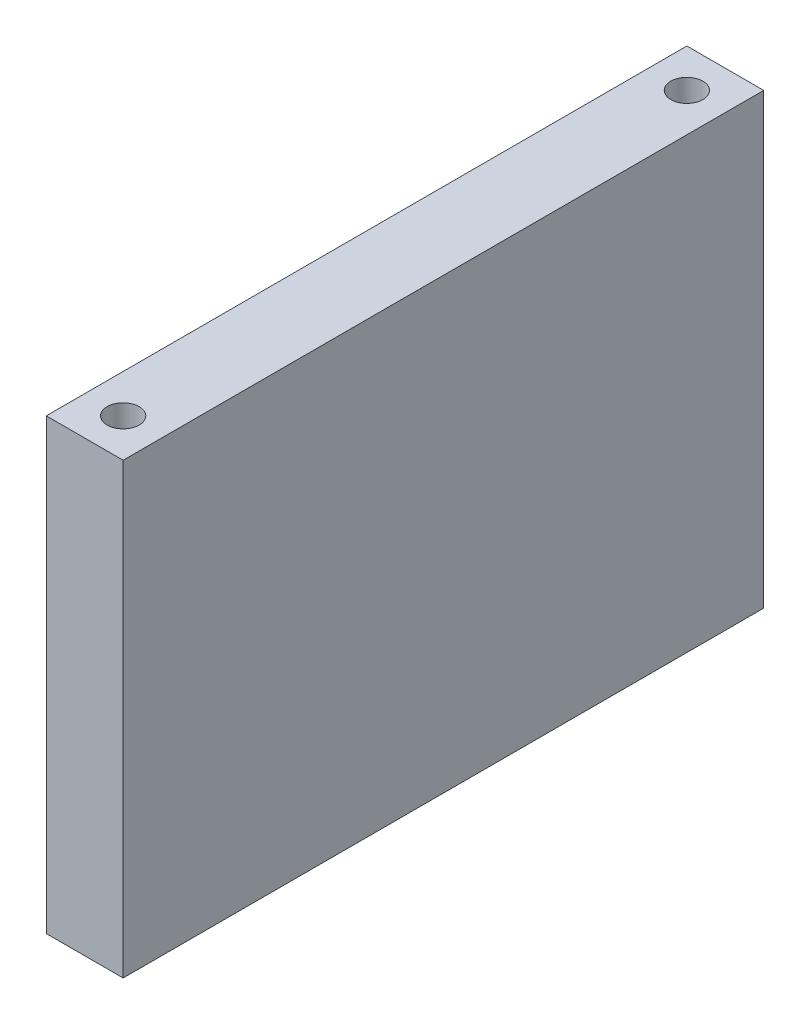
ISO-10303-21;
HEADER;
FILE_DESCRIPTION(('STEP AP214'),'2;1');
FILE_NAME('part.step','',(''),(''),'','','');
FILE_SCHEMA(('AUTOMOTIVE_DESIGN { 1 0 10303 214 1 1 1 1 }'));
ENDSEC;
DATA;
#1=APPLICATION_CONTEXT('core data for automotive mechanical design processes');
#2=APPLICATION_PROTOCOL_DEFINITION('international standard','automotive_design',2000,#1);
#3=PRODUCT_CONTEXT('',#1,'mechanical');
#4=PRODUCT('Part','Part','',(#3));
#5=PRODUCT_RELATED_PRODUCT_CATEGORY('part','',(#4));
#6=PRODUCT_DEFINITION_FORMATION('','',#4);
#7=PRODUCT_DEFINITION_CONTEXT('part definition',#1,'design');
#8=PRODUCT_DEFINITION('design','',#6,#7);
#9=PRODUCT_DEFINITION_SHAPE('','',#8);
#10=(LENGTH_UNIT() NAMED_UNIT(*) SI_UNIT(.MILLI.,.METRE.));
#11=(NAMED_UNIT(*) PLANE_ANGLE_UNIT() SI_UNIT($,.RADIAN.));
#12=(NAMED_UNIT(*) SI_UNIT($,.STERADIAN.) SOLID_ANGLE_UNIT());
#13=UNCERTAINTY_MEASURE_WITH_UNIT(LENGTH_MEASURE(1.E-05),#10,'distance_accuracy_value','');
#14=(GEOMETRIC_REPRESENTATION_CONTEXT(3) GLOBAL_UNCERTAINTY_ASSIGNED_CONTEXT((#13)) GLOBAL_UNIT_ASSIGNED_CONTEXT((#10,
#11,#12)) REPRESENTATION_CONTEXT('',''));
#15=CARTESIAN_POINT('',(0.,0.,0.));
#16=DIRECTION('',(0.,0.,1.));
#17=DIRECTION('',(1.,0.,0.));
#18=AXIS2_PLACEMENT_3D('',#15,#16,#17);
#19=CARTESIAN_POINT('',(0.,0.,0.));
#20=DIRECTION('',(0.,-1.,0.));
#21=DIRECTION('',(1.,0.,0.));
#22=AXIS2_PLACEMENT_3D('',#19,#20,#21);
#23=PLANE('',#22);
#24=DIRECTION('',(1.,0.,0.));
#25=VECTOR('',#24,1.);
#26=CARTESIAN_POINT('',(0.,0.,25.));
#27=LINE('',#26,#25);
#28=CARTESIAN_POINT('',(19.,0.,25.));
#29=VERTEX_POINT('',#28);
#30=CARTESIAN_POINT('',(25.,0.,25.));
#31=VERTEX_POINT('',#30);
#32=EDGE_CURVE('E74',#29,#31,#27,.T.);
#33=ORIENTED_EDGE('',*,*,#32,.T.);
#34=DIRECTION('',(0.,0.,1.));
#35=VECTOR('',#34,1.);
#36=CARTESIAN_POINT('',(25.,0.,0.));
#37=LINE('',#36,#35);
#38=CARTESIAN_POINT('',(25.,0.,-25.));
#39=VERTEX_POINT('',#38);
#40=EDGE_CURVE('E11',#39,#31,#37,.T.);
#41=ORIENTED_EDGE('',*,*,#40,.F.);
#42=DIRECTION('',(1.,0.,0.));
#43=VECTOR('',#42,1.);
#44=CARTESIAN_POINT('',(0.,0.,-25.));
#45=LINE('',#44,#43);
#46=CARTESIAN_POINT('',(19.,0.,-25.));
#47=VERTEX_POINT('',#46);
#48=EDGE_CURVE('E27',#47,#39,#45,.T.);
#49=ORIENTED_EDGE('',*,*,#48,.F.);
#50=DIRECTION('',(0.,0.,-1.));
#51=VECTOR('',#50,1.);
#52=CARTESIAN_POINT('',(19.,0.,0.));
#53=LINE('',#52,#51);
#54=EDGE_CURVE('E117',#29,#47,#53,.T.);
#55=ORIENTED_EDGE('',*,*,#54,.F.);
#56=EDGE_LOOP('',(#33,#41,#49,#55));
#57=FACE_BOUND('',#56,.T.);
#58=CARTESIAN_POINT('',(22.,0.,-22.));
#59=DIRECTION('',(0.,-1.,0.));
#60=DIRECTION('',(0.,0.,-1.));
#61=AXIS2_PLACEMENT_3D('',#58,#59,#60);
#62=CIRCLE('',#61,1.25);
#63=CARTESIAN_POINT('',(22.,0.,-23.25));
#64=VERTEX_POINT('',#63);
#65=EDGE_CURVE('E144',#64,#64,#62,.T.);
#66=ORIENTED_EDGE('',*,*,#65,.T.);
#67=EDGE_LOOP('',(#66));
#68=FACE_BOUND('',#67,.T.);
#69=CARTESIAN_POINT('',(22.,0.,22.));
#70=DIRECTION('',(0.,1.,0.));
#71=DIRECTION('',(0.,0.,-1.));
#72=AXIS2_PLACEMENT_3D('',#69,#70,#71);
#73=CIRCLE('',#72,1.25);
#74=CARTESIAN_POINT('',(22.,0.,20.75));
#75=VERTEX_POINT('',#74);
#76=EDGE_CURVE('E147',#75,#75,#73,.T.);
#77=ORIENTED_EDGE('',*,*,#76,.F.);
#78=EDGE_LOOP('',(#77));
#79=FACE_BOUND('',#78,.T.);
#80=ADVANCED_FACE('F17',(#57,#68,#79),#23,.F.);
#81=CARTESIAN_POINT('',(15.6554577499628,-35.,0.));
#82=DIRECTION('',(0.,-1.,0.));
#83=DIRECTION('',(1.,0.,0.));
#84=AXIS2_PLACEMENT_3D('',#81,#82,#83);
#85=PLANE('',#84);
#86=DIRECTION('',(1.,0.,0.));
#87=VECTOR('',#86,1.);
#88=CARTESIAN_POINT('',(0.,-35.,25.));
#89=LINE('',#88,#87);
#90=CARTESIAN_POINT('',(19.,-35.,25.));
#91=VERTEX_POINT('',#90);
#92=CARTESIAN_POINT('',(25.,-35.,25.));
#93=VERTEX_POINT('',#92);
#94=EDGE_CURVE('E76',#91,#93,#89,.T.);
#95=ORIENTED_EDGE('',*,*,#94,.F.);
#96=DIRECTION('',(0.,0.,-1.));
#97=VECTOR('',#96,1.);
#98=CARTESIAN_POINT('',(19.,-35.,0.));
#99=LINE('',#98,#97);
#100=CARTESIAN_POINT('',(19.,-35.,-25.));
#101=VERTEX_POINT('',#100);
#102=EDGE_CURVE('E83',#91,#101,#99,.T.);
#103=ORIENTED_EDGE('',*,*,#102,.T.);
#104=DIRECTION('',(1.,0.,0.));
#105=VECTOR('',#104,1.);
#106=CARTESIAN_POINT('',(0.,-35.,-25.));
#107=LINE('',#106,#105);
#108=CARTESIAN_POINT('',(25.,-35.,-25.));
#109=VERTEX_POINT('',#108);
#110=EDGE_CURVE('E89',#101,#109,#107,.T.);
#111=ORIENTED_EDGE('',*,*,#110,.T.);
#112=DIRECTION('',(0.,0.,1.));
#113=VECTOR('',#112,1.);
#114=CARTESIAN_POINT('',(25.,-35.,0.));
#115=LINE('',#114,#113);
#116=EDGE_CURVE('E70',#109,#93,#115,.T.);
#117=ORIENTED_EDGE('',*,*,#116,.T.);
#118=EDGE_LOOP('',(#95,#103,#111,#117));
#119=FACE_BOUND('',#118,.T.);
#120=CARTESIAN_POINT('',(22.,-35.,-22.));
#121=DIRECTION('',(0.,-1.,0.));
#122=DIRECTION('',(0.,0.,-1.));
#123=AXIS2_PLACEMENT_3D('',#120,#121,#122);
#124=CIRCLE('',#123,1.25);
#125=CARTESIAN_POINT('',(22.,-35.,-23.25));
#126=VERTEX_POINT('',#125);
#127=EDGE_CURVE('E157',#126,#126,#124,.T.);
#128=ORIENTED_EDGE('',*,*,#127,.F.);
#129=EDGE_LOOP('',(#128));
#130=FACE_BOUND('',#129,.T.);
#131=CARTESIAN_POINT('',(22.,-35.,22.));
#132=DIRECTION('',(0.,1.,0.));
#133=DIRECTION('',(0.,0.,-1.));
#134=AXIS2_PLACEMENT_3D('',#131,#132,#133);
#135=CIRCLE('',#134,1.25);
#136=CARTESIAN_POINT('',(22.,-35.,20.75));
#137=VERTEX_POINT('',#136);
#138=EDGE_CURVE('E99',#137,#137,#135,.T.);
#139=ORIENTED_EDGE('',*,*,#138,.T.);
#140=EDGE_LOOP('',(#139));
#141=FACE_BOUND('',#140,.T.);
#142=ADVANCED_FACE('F86',(#119,#130,#141),#85,.T.);
#143=CARTESIAN_POINT('',(0.,-35.002,25.));
#144=DIRECTION('',(0.,0.,1.));
#145=DIRECTION('',(1.,0.,0.));
#146=AXIS2_PLACEMENT_3D('',#143,#144,#145);
#147=PLANE('',#146);
#148=DIRECTION('',(0.,1.,0.));
#149=VECTOR('',#148,1.);
#150=CARTESIAN_POINT('',(19.,-35.002,25.));
#151=LINE('',#150,#149);
#152=EDGE_CURVE('E78',#91,#29,#151,.T.);
#153=ORIENTED_EDGE('',*,*,#152,.F.);
#154=ORIENTED_EDGE('',*,*,#94,.T.);
#155=DIRECTION('',(0.,1.,0.));
#156=VECTOR('',#155,1.);
#157=CARTESIAN_POINT('',(25.,-35.002,25.));
#158=LINE('',#157,#156);
#159=EDGE_CURVE('E21',#93,#31,#158,.T.);
#160=ORIENTED_EDGE('',*,*,#159,.T.);
#161=ORIENTED_EDGE('',*,*,#32,.F.);
#162=EDGE_LOOP('',(#153,#154,#160,#161));
#163=FACE_BOUND('',#162,.T.);
#164=ADVANCED_FACE('F77',(#163),#147,.T.);
#165=CARTESIAN_POINT('',(19.,-35.002,0.));
#166=DIRECTION('',(1.,0.,0.));
#167=DIRECTION('',(0.,0.,-1.));
#168=AXIS2_PLACEMENT_3D('',#165,#166,#167);
#169=PLANE('',#168);
#170=ORIENTED_EDGE('',*,*,#102,.F.);
#171=ORIENTED_EDGE('',*,*,#152,.T.);
#172=ORIENTED_EDGE('',*,*,#54,.T.);
#173=DIRECTION('',(0.,1.,0.));
#174=VECTOR('',#173,1.);
#175=CARTESIAN_POINT('',(19.,-35.002,-25.));
#176=LINE('',#175,#174);
#177=EDGE_CURVE('E105',#101,#47,#176,.T.);
#178=ORIENTED_EDGE('',*,*,#177,.F.);
#179=EDGE_LOOP('',(#170,#171,#172,#178));
#180=FACE_BOUND('',#179,.T.);
#181=ADVANCED_FACE('F136',(#180),#169,.F.);
#182=CARTESIAN_POINT('',(0.,-35.002,-25.));
#183=DIRECTION('',(0.,0.,1.));
#184=DIRECTION('',(1.,0.,0.));
#185=AXIS2_PLACEMENT_3D('',#182,#183,#184);
#186=PLANE('',#185);
#187=ORIENTED_EDGE('',*,*,#110,.F.);
#188=ORIENTED_EDGE('',*,*,#177,.T.);
#189=ORIENTED_EDGE('',*,*,#48,.T.);
#190=DIRECTION('',(0.,1.,0.));
#191=VECTOR('',#190,1.);
#192=CARTESIAN_POINT('',(25.,-35.002,-25.));
#193=LINE('',#192,#191);
#194=EDGE_CURVE('E46',#109,#39,#193,.T.);
#195=ORIENTED_EDGE('',*,*,#194,.F.);
#196=EDGE_LOOP('',(#187,#188,#189,#195));
#197=FACE_BOUND('',#196,.T.);
#198=ADVANCED_FACE('F134',(#197),#186,.F.);
#199=CARTESIAN_POINT('',(25.,-35.002,0.));
#200=DIRECTION('',(-1.,0.,0.));
#201=DIRECTION('',(0.,0.,1.));
#202=AXIS2_PLACEMENT_3D('',#199,#200,#201);
#203=PLANE('',#202);
#204=ORIENTED_EDGE('',*,*,#116,.F.);
#205=ORIENTED_EDGE('',*,*,#194,.T.);
#206=ORIENTED_EDGE('',*,*,#40,.T.);
#207=ORIENTED_EDGE('',*,*,#159,.F.);
#208=EDGE_LOOP('',(#204,#205,#206,#207));
#209=FACE_BOUND('',#208,.T.);
#210=ADVANCED_FACE('F19',(#209),#203,.F.);
#211=CARTESIAN_POINT('',(22.,-25.,-22.));
#212=DIRECTION('',(0.,-1.,0.));
#213=DIRECTION('',(0.,0.,-1.));
#214=AXIS2_PLACEMENT_3D('',#211,#212,#213);
#215=CYLINDRICAL_SURFACE('',#214,1.25);
#216=CARTESIAN_POINT('',(22.,-25.,-22.));
#217=DIRECTION('',(0.,-1.,0.));
#218=DIRECTION('',(0.,0.,-1.));
#219=AXIS2_PLACEMENT_3D('',#216,#217,#218);
#220=CIRCLE('',#219,1.25);
#221=CARTESIAN_POINT('',(22.,-25.,-23.25));
#222=VERTEX_POINT('',#221);
#223=EDGE_CURVE('E168',#222,#222,#220,.T.);
#224=ORIENTED_EDGE('',*,*,#223,.F.);
#225=EDGE_LOOP('',(#224));
#226=FACE_BOUND('',#225,.T.);
#227=ORIENTED_EDGE('',*,*,#127,.T.);
#228=EDGE_LOOP('',(#227));
#229=FACE_BOUND('',#228,.T.);
#230=ADVANCED_FACE('F176',(#226,#229),#215,.F.);
#231=CARTESIAN_POINT('',(-0.875,-25.,0.));
#232=DIRECTION('',(0.,-1.,0.));
#233=DIRECTION('',(1.,0.,0.));
#234=AXIS2_PLACEMENT_3D('',#231,#232,#233);
#235=PLANE('',#234);
#236=ORIENTED_EDGE('',*,*,#223,.T.);
#237=EDGE_LOOP('',(#236));
#238=FACE_BOUND('',#237,.T.);
#239=ADVANCED_FACE('F185',(#238),#235,.T.);
#240=CARTESIAN_POINT('',(22.,-25.,22.));
#241=DIRECTION('',(0.,-1.,0.));
#242=DIRECTION('',(0.,0.,-1.));
#243=AXIS2_PLACEMENT_3D('',#240,#241,#242);
#244=CYLINDRICAL_SURFACE('',#243,1.25);
#245=CARTESIAN_POINT('',(22.,-25.,22.));
#246=DIRECTION('',(0.,1.,0.));
#247=DIRECTION('',(0.,0.,-1.));
#248=AXIS2_PLACEMENT_3D('',#245,#246,#247);
#249=CIRCLE('',#248,1.25);
#250=CARTESIAN_POINT('',(22.,-25.,20.75));
#251=VERTEX_POINT('',#250);
#252=EDGE_CURVE('E91',#251,#251,#249,.T.);
#253=ORIENTED_EDGE('',*,*,#252,.T.);
#254=EDGE_LOOP('',(#253));
#255=FACE_BOUND('',#254,.T.);
#256=ORIENTED_EDGE('',*,*,#138,.F.);
#257=EDGE_LOOP('',(#256));
#258=FACE_BOUND('',#257,.T.);
#259=ADVANCED_FACE('F182',(#255,#258),#244,.F.);
#260=CARTESIAN_POINT('',(-0.875,-25.,0.));
#261=DIRECTION('',(0.,-1.,0.));
#262=DIRECTION('',(1.,0.,0.));
#263=AXIS2_PLACEMENT_3D('',#260,#261,#262);
#264=PLANE('',#263);
#265=ORIENTED_EDGE('',*,*,#252,.F.);
#266=EDGE_LOOP('',(#265));
#267=FACE_BOUND('',#266,.T.);
#268=ADVANCED_FACE('F184',(#267),#264,.T.);
#269=CARTESIAN_POINT('',(22.,-10.,-22.));
#270=DIRECTION('',(0.,1.,0.));
#271=DIRECTION('',(0.,0.,1.));
#272=AXIS2_PLACEMENT_3D('',#269,#270,#271);
#273=CYLINDRICAL_SURFACE('',#272,1.25);
#274=CARTESIAN_POINT('',(22.,-10.,-22.));
#275=DIRECTION('',(0.,-1.,0.));
#276=DIRECTION('',(0.,0.,-1.));
#277=AXIS2_PLACEMENT_3D('',#274,#275,#276);
#278=CIRCLE('',#277,1.25);
#279=CARTESIAN_POINT('',(22.,-10.,-23.25));
#280=VERTEX_POINT('',#279);
#281=EDGE_CURVE('E151',#280,#280,#278,.T.);
#282=ORIENTED_EDGE('',*,*,#281,.T.);
#283=EDGE_LOOP('',(#282));
#284=FACE_BOUND('',#283,.T.);
#285=ORIENTED_EDGE('',*,*,#65,.F.);
#286=EDGE_LOOP('',(#285));
#287=FACE_BOUND('',#286,.T.);
#288=ADVANCED_FACE('F193',(#284,#287),#273,.F.);
#289=CARTESIAN_POINT('',(-0.875,-10.,0.));
#290=DIRECTION('',(0.,1.,0.));
#291=DIRECTION('',(1.,0.,0.));
#292=AXIS2_PLACEMENT_3D('',#289,#290,#291);
#293=PLANE('',#292);
#294=ORIENTED_EDGE('',*,*,#281,.F.);
#295=EDGE_LOOP('',(#294));
#296=FACE_BOUND('',#295,.T.);
#297=ADVANCED_FACE('F247',(#296),#293,.T.);
#298=CARTESIAN_POINT('',(22.,-10.,22.));
#299=DIRECTION('',(0.,1.,0.));
#300=DIRECTION('',(0.,0.,1.));
#301=AXIS2_PLACEMENT_3D('',#298,#299,#300);
#302=CYLINDRICAL_SURFACE('',#301,1.25);
#303=CARTESIAN_POINT('',(22.,-10.,22.));
#304=DIRECTION('',(0.,1.,0.));
#305=DIRECTION('',(0.,0.,-1.));
#306=AXIS2_PLACEMENT_3D('',#303,#304,#305);
#307=CIRCLE('',#306,1.25);
#308=CARTESIAN_POINT('',(22.,-10.,20.75));
#309=VERTEX_POINT('',#308);
#310=EDGE_CURVE('E150',#309,#309,#307,.T.);
#311=ORIENTED_EDGE('',*,*,#310,.F.);
#312=EDGE_LOOP('',(#311));
#313=FACE_BOUND('',#312,.T.);
#314=ORIENTED_EDGE('',*,*,#76,.T.);
#315=EDGE_LOOP('',(#314));
#316=FACE_BOUND('',#315,.T.);
#317=ADVANCED_FACE('F257',(#313,#316),#302,.F.);
#318=CARTESIAN_POINT('',(-0.875,-10.,0.));
#319=DIRECTION('',(0.,1.,0.));
#320=DIRECTION('',(1.,0.,0.));
#321=AXIS2_PLACEMENT_3D('',#318,#319,#320);
#322=PLANE('',#321);
#323=ORIENTED_EDGE('',*,*,#310,.T.);
#324=EDGE_LOOP('',(#323));
#325=FACE_BOUND('',#324,.T.);
#326=ADVANCED_FACE('F268',(#325),#322,.T.);
#327=CLOSED_SHELL('',(#80,#142,#164,#181,#198,#210,#230,#239,#259,#268,#288,#297,#317,#326));
#328=MANIFOLD_SOLID_BREP('B1',#327);
#329=ADVANCED_BREP_SHAPE_REPRESENTATION('',(#18,#328),#14);
#330=SHAPE_DEFINITION_REPRESENTATION(#9,#329);
ENDSEC;
END-ISO-10303-21;
